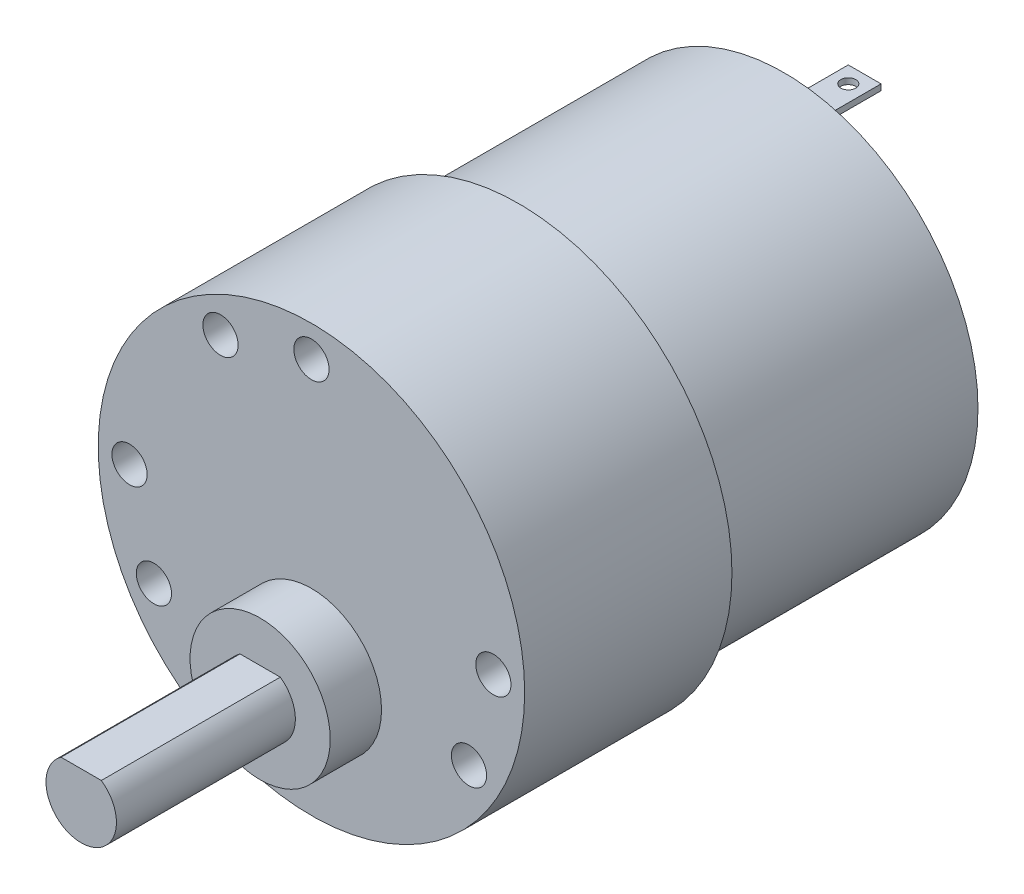
ISO-10303-21;
HEADER;
FILE_DESCRIPTION(('STEP AP214'),'2;1');
FILE_NAME('part.step','',(''),(''),'','','');
FILE_SCHEMA(('AUTOMOTIVE_DESIGN { 1 0 10303 214 1 1 1 1 }'));
ENDSEC;
DATA;
#1=APPLICATION_CONTEXT('core data for automotive mechanical design processes');
#2=APPLICATION_PROTOCOL_DEFINITION('international standard','automotive_design',2000,#1);
#3=PRODUCT_CONTEXT('',#1,'mechanical');
#4=PRODUCT('Part','Part','',(#3));
#5=PRODUCT_RELATED_PRODUCT_CATEGORY('part','',(#4));
#6=PRODUCT_DEFINITION_FORMATION('','',#4);
#7=PRODUCT_DEFINITION_CONTEXT('part definition',#1,'design');
#8=PRODUCT_DEFINITION('design','',#6,#7);
#9=PRODUCT_DEFINITION_SHAPE('','',#8);
#10=(LENGTH_UNIT() NAMED_UNIT(*) SI_UNIT(.MILLI.,.METRE.));
#11=(NAMED_UNIT(*) PLANE_ANGLE_UNIT() SI_UNIT($,.RADIAN.));
#12=(NAMED_UNIT(*) SI_UNIT($,.STERADIAN.) SOLID_ANGLE_UNIT());
#13=UNCERTAINTY_MEASURE_WITH_UNIT(LENGTH_MEASURE(1.E-05),#10,'distance_accuracy_value','');
#14=(GEOMETRIC_REPRESENTATION_CONTEXT(3) GLOBAL_UNCERTAINTY_ASSIGNED_CONTEXT((#13)) GLOBAL_UNIT_ASSIGNED_CONTEXT((#10,
#11,#12)) REPRESENTATION_CONTEXT('',''));
#15=CARTESIAN_POINT('',(0.,0.,0.));
#16=DIRECTION('',(0.,0.,1.));
#17=DIRECTION('',(1.,0.,0.));
#18=AXIS2_PLACEMENT_3D('',#15,#16,#17);
#19=CARTESIAN_POINT('',(0.,-12.7,-23.876));
#20=DIRECTION('',(0.,0.,-1.));
#21=DIRECTION('',(-1.,0.,0.));
#22=AXIS2_PLACEMENT_3D('',#19,#20,#21);
#23=PLANE('',#22);
#24=CARTESIAN_POINT('',(0.,-12.7,-23.876));
#25=DIRECTION('',(0.,0.,-1.));
#26=DIRECTION('',(-1.,0.,0.));
#27=AXIS2_PLACEMENT_3D('',#24,#25,#26);
#28=CIRCLE('',#27,2.413);
#29=CARTESIAN_POINT('',(-2.413,-12.7,-23.876));
#30=VERTEX_POINT('',#29);
#31=EDGE_CURVE('E278',#30,#30,#28,.T.);
#32=ORIENTED_EDGE('',*,*,#31,.T.);
#33=EDGE_LOOP('',(#32));
#34=FACE_BOUND('',#33,.T.);
#35=DIRECTION('',(-1.,0.,0.));
#36=VECTOR('',#35,1.);
#37=CARTESIAN_POINT('',(-1.397,-12.446,-23.876));
#38=LINE('',#37,#36);
#39=CARTESIAN_POINT('',(1.397,-12.446,-23.876));
#40=VERTEX_POINT('',#39);
#41=CARTESIAN_POINT('',(-1.397,-12.446,-23.876));
#42=VERTEX_POINT('',#41);
#43=EDGE_CURVE('E48',#40,#42,#38,.T.);
#44=ORIENTED_EDGE('',*,*,#43,.T.);
#45=DIRECTION('',(0.,1.,0.));
#46=VECTOR('',#45,1.);
#47=CARTESIAN_POINT('',(-1.397,-12.954,-23.876));
#48=LINE('',#47,#46);
#49=CARTESIAN_POINT('',(-1.397,-12.954,-23.876));
#50=VERTEX_POINT('',#49);
#51=EDGE_CURVE('E213',#50,#42,#48,.T.);
#52=ORIENTED_EDGE('',*,*,#51,.F.);
#53=DIRECTION('',(-1.,0.,0.));
#54=VECTOR('',#53,1.);
#55=CARTESIAN_POINT('',(-1.397,-12.954,-23.876));
#56=LINE('',#55,#54);
#57=CARTESIAN_POINT('',(1.397,-12.954,-23.876));
#58=VERTEX_POINT('',#57);
#59=EDGE_CURVE('E188',#58,#50,#56,.T.);
#60=ORIENTED_EDGE('',*,*,#59,.F.);
#61=DIRECTION('',(0.,1.,0.));
#62=VECTOR('',#61,1.);
#63=CARTESIAN_POINT('',(1.397,-12.954,-23.876));
#64=LINE('',#63,#62);
#65=EDGE_CURVE('E198',#58,#40,#64,.T.);
#66=ORIENTED_EDGE('',*,*,#65,.T.);
#67=EDGE_LOOP('',(#44,#52,#60,#66));
#68=FACE_BOUND('',#67,.T.);
#69=ADVANCED_FACE('F33',(#34,#68),#23,.T.);
#70=CARTESIAN_POINT('',(0.,12.7,-23.876));
#71=DIRECTION('',(0.,0.,-1.));
#72=DIRECTION('',(-1.,0.,0.));
#73=AXIS2_PLACEMENT_3D('',#70,#71,#72);
#74=PLANE('',#73);
#75=CARTESIAN_POINT('',(0.,12.7,-23.876));
#76=DIRECTION('',(0.,0.,-1.));
#77=DIRECTION('',(-1.,0.,0.));
#78=AXIS2_PLACEMENT_3D('',#75,#76,#77);
#79=CIRCLE('',#78,2.413);
#80=CARTESIAN_POINT('',(-2.413,12.7,-23.876));
#81=VERTEX_POINT('',#80);
#82=EDGE_CURVE('E272',#81,#81,#79,.T.);
#83=ORIENTED_EDGE('',*,*,#82,.T.);
#84=EDGE_LOOP('',(#83));
#85=FACE_BOUND('',#84,.T.);
#86=DIRECTION('',(1.,0.,0.));
#87=VECTOR('',#86,1.);
#88=CARTESIAN_POINT('',(1.397,12.446,-23.876));
#89=LINE('',#88,#87);
#90=CARTESIAN_POINT('',(-1.397,12.446,-23.876));
#91=VERTEX_POINT('',#90);
#92=CARTESIAN_POINT('',(1.397,12.446,-23.876));
#93=VERTEX_POINT('',#92);
#94=EDGE_CURVE('E56',#91,#93,#89,.T.);
#95=ORIENTED_EDGE('',*,*,#94,.T.);
#96=DIRECTION('',(0.,-1.,0.));
#97=VECTOR('',#96,1.);
#98=CARTESIAN_POINT('',(1.397,12.954,-23.876));
#99=LINE('',#98,#97);
#100=CARTESIAN_POINT('',(1.397,12.954,-23.876));
#101=VERTEX_POINT('',#100);
#102=EDGE_CURVE('E247',#101,#93,#99,.T.);
#103=ORIENTED_EDGE('',*,*,#102,.F.);
#104=DIRECTION('',(1.,0.,0.));
#105=VECTOR('',#104,1.);
#106=CARTESIAN_POINT('',(1.397,12.954,-23.876));
#107=LINE('',#106,#105);
#108=CARTESIAN_POINT('',(-1.397,12.954,-23.876));
#109=VERTEX_POINT('',#108);
#110=EDGE_CURVE('E222',#109,#101,#107,.T.);
#111=ORIENTED_EDGE('',*,*,#110,.F.);
#112=DIRECTION('',(0.,-1.,0.));
#113=VECTOR('',#112,1.);
#114=CARTESIAN_POINT('',(-1.397,12.954,-23.876));
#115=LINE('',#114,#113);
#116=EDGE_CURVE('E232',#109,#91,#115,.T.);
#117=ORIENTED_EDGE('',*,*,#116,.T.);
#118=EDGE_LOOP('',(#95,#103,#111,#117));
#119=FACE_BOUND('',#118,.T.);
#120=ADVANCED_FACE('F321',(#85,#119),#74,.T.);
#121=CARTESIAN_POINT('',(0.,-7.366,22.0218));
#122=DIRECTION('',(0.,0.,1.));
#123=DIRECTION('',(1.,0.,0.));
#124=AXIS2_PLACEMENT_3D('',#121,#122,#123);
#125=PLANE('',#124);
#126=CARTESIAN_POINT('',(0.,-7.366,22.0218));
#127=DIRECTION('',(0.,0.,1.));
#128=DIRECTION('',(1.,0.,0.));
#129=AXIS2_PLACEMENT_3D('',#126,#127,#128);
#130=CIRCLE('',#129,5.969);
#131=CARTESIAN_POINT('',(5.969,-7.366,22.0218));
#132=VERTEX_POINT('',#131);
#133=EDGE_CURVE('E266',#132,#132,#130,.T.);
#134=ORIENTED_EDGE('',*,*,#133,.T.);
#135=EDGE_LOOP('',(#134));
#136=FACE_BOUND('',#135,.T.);
#137=DIRECTION('',(-1.,0.,0.));
#138=VECTOR('',#137,1.);
#139=CARTESIAN_POINT('',(-1.71565701700544,-4.905,22.0218));
#140=LINE('',#139,#138);
#141=CARTESIAN_POINT('',(1.71565701700544,-4.905,22.0218));
#142=VERTEX_POINT('',#141);
#143=CARTESIAN_POINT('',(-1.71565701700544,-4.905,22.0218));
#144=VERTEX_POINT('',#143);
#145=EDGE_CURVE('E255',#142,#144,#140,.T.);
#146=ORIENTED_EDGE('',*,*,#145,.F.);
#147=CARTESIAN_POINT('',(0.,-7.366,22.0218));
#148=DIRECTION('',(0.,0.,1.));
#149=DIRECTION('',(1.,0.,0.));
#150=AXIS2_PLACEMENT_3D('',#147,#148,#149);
#151=CIRCLE('',#150,3.);
#152=EDGE_CURVE('E250',#144,#142,#151,.T.);
#153=ORIENTED_EDGE('',*,*,#152,.F.);
#154=EDGE_LOOP('',(#146,#153));
#155=FACE_BOUND('',#154,.T.);
#156=ADVANCED_FACE('F327',(#136,#155),#125,.T.);
#157=CARTESIAN_POINT('',(0.,0.,17.653));
#158=DIRECTION('',(0.,0.,1.));
#159=DIRECTION('',(1.,0.,0.));
#160=AXIS2_PLACEMENT_3D('',#157,#158,#159);
#161=PLANE('',#160);
#162=CARTESIAN_POINT('',(-7.74699999999983,13.4181976062362,17.653));
#163=DIRECTION('',(0.,0.,1.));
#164=DIRECTION('',(1.,0.,0.));
#165=AXIS2_PLACEMENT_3D('',#162,#163,#164);
#166=CIRCLE('',#165,1.49999999999999);
#167=CARTESIAN_POINT('',(-6.24699999999984,13.4181976062362,17.653));
#168=VERTEX_POINT('',#167);
#169=EDGE_CURVE('E142',#168,#168,#166,.T.);
#170=ORIENTED_EDGE('',*,*,#169,.F.);
#171=EDGE_LOOP('',(#170));
#172=FACE_BOUND('',#171,.T.);
#173=CARTESIAN_POINT('',(-15.494,1.62291035592107E-13,17.653));
#174=DIRECTION('',(0.,0.,1.));
#175=DIRECTION('',(1.,0.,0.));
#176=AXIS2_PLACEMENT_3D('',#173,#174,#175);
#177=CIRCLE('',#176,1.49999999999999);
#178=CARTESIAN_POINT('',(-13.994,1.62291035592107E-13,17.653));
#179=VERTEX_POINT('',#178);
#180=EDGE_CURVE('E141',#179,#179,#177,.T.);
#181=ORIENTED_EDGE('',*,*,#180,.F.);
#182=EDGE_LOOP('',(#181));
#183=FACE_BOUND('',#182,.T.);
#184=CARTESIAN_POINT('',(-13.4181976062362,-7.74699999999987,17.653));
#185=DIRECTION('',(0.,0.,1.));
#186=DIRECTION('',(1.,0.,0.));
#187=AXIS2_PLACEMENT_3D('',#184,#185,#186);
#188=CIRCLE('',#187,1.49999999999999);
#189=CARTESIAN_POINT('',(-11.9181976062362,-7.74699999999987,17.653));
#190=VERTEX_POINT('',#189);
#191=EDGE_CURVE('E152',#190,#190,#188,.T.);
#192=ORIENTED_EDGE('',*,*,#191,.F.);
#193=EDGE_LOOP('',(#192));
#194=FACE_BOUND('',#193,.T.);
#195=CARTESIAN_POINT('',(-7.74700000000011,-13.418197606236,17.653));
#196=DIRECTION('',(0.,0.,1.));
#197=DIRECTION('',(1.,0.,0.));
#198=AXIS2_PLACEMENT_3D('',#195,#196,#197);
#199=CIRCLE('',#198,1.49999999999999);
#200=CARTESIAN_POINT('',(-6.24700000000012,-13.418197606236,17.653));
#201=VERTEX_POINT('',#200);
#202=EDGE_CURVE('E158',#201,#201,#199,.T.);
#203=ORIENTED_EDGE('',*,*,#202,.F.);
#204=EDGE_LOOP('',(#203));
#205=FACE_BOUND('',#204,.T.);
#206=CARTESIAN_POINT('',(13.4181976062361,-7.74700000000006,17.653));
#207=DIRECTION('',(0.,0.,1.));
#208=DIRECTION('',(1.,0.,0.));
#209=AXIS2_PLACEMENT_3D('',#206,#207,#208);
#210=CIRCLE('',#209,1.49999999999999);
#211=CARTESIAN_POINT('',(14.918197606236,-7.74700000000006,17.653));
#212=VERTEX_POINT('',#211);
#213=EDGE_CURVE('E164',#212,#212,#210,.T.);
#214=ORIENTED_EDGE('',*,*,#213,.F.);
#215=EDGE_LOOP('',(#214));
#216=FACE_BOUND('',#215,.T.);
#217=CARTESIAN_POINT('',(15.494,0.,17.653));
#218=DIRECTION('',(0.,0.,1.));
#219=DIRECTION('',(1.,0.,0.));
#220=AXIS2_PLACEMENT_3D('',#217,#218,#219);
#221=CIRCLE('',#220,1.49999999999999);
#222=CARTESIAN_POINT('',(16.994,0.,17.653));
#223=VERTEX_POINT('',#222);
#224=EDGE_CURVE('E170',#223,#223,#221,.T.);
#225=ORIENTED_EDGE('',*,*,#224,.F.);
#226=EDGE_LOOP('',(#225));
#227=FACE_BOUND('',#226,.T.);
#228=CARTESIAN_POINT('',(0.,15.494,17.653));
#229=DIRECTION('',(0.,0.,1.));
#230=DIRECTION('',(1.,0.,0.));
#231=AXIS2_PLACEMENT_3D('',#228,#229,#230);
#232=CIRCLE('',#231,1.49999999999999);
#233=CARTESIAN_POINT('',(1.49999999999999,15.494,17.653));
#234=VERTEX_POINT('',#233);
#235=EDGE_CURVE('E176',#234,#234,#232,.T.);
#236=ORIENTED_EDGE('',*,*,#235,.F.);
#237=EDGE_LOOP('',(#236));
#238=FACE_BOUND('',#237,.T.);
#239=CARTESIAN_POINT('',(0.,0.,17.653));
#240=DIRECTION('',(0.,0.,1.));
#241=DIRECTION('',(1.,0.,0.));
#242=AXIS2_PLACEMENT_3D('',#239,#240,#241);
#243=CIRCLE('',#242,18.161);
#244=CARTESIAN_POINT('',(18.161,0.,17.653));
#245=VERTEX_POINT('',#244);
#246=EDGE_CURVE('E41',#245,#245,#243,.T.);
#247=ORIENTED_EDGE('',*,*,#246,.T.);
#248=EDGE_LOOP('',(#247));
#249=FACE_BOUND('',#248,.T.);
#250=CARTESIAN_POINT('',(0.,-7.366,17.653));
#251=DIRECTION('',(0.,0.,1.));
#252=DIRECTION('',(1.,0.,0.));
#253=AXIS2_PLACEMENT_3D('',#250,#251,#252);
#254=CIRCLE('',#253,5.969);
#255=CARTESIAN_POINT('',(5.969,-7.366,17.653));
#256=VERTEX_POINT('',#255);
#257=EDGE_CURVE('E265',#256,#256,#254,.T.);
#258=ORIENTED_EDGE('',*,*,#257,.F.);
#259=EDGE_LOOP('',(#258));
#260=FACE_BOUND('',#259,.T.);
#261=ADVANCED_FACE('F341',(#172,#183,#194,#205,#216,#227,#238,#249,#260),#161,.T.);
#262=CARTESIAN_POINT('',(0.,0.,-22.606));
#263=DIRECTION('',(0.,0.,-1.));
#264=DIRECTION('',(-1.,0.,0.));
#265=AXIS2_PLACEMENT_3D('',#262,#263,#264);
#266=PLANE('',#265);
#267=CARTESIAN_POINT('',(0.,-12.7,-22.606));
#268=DIRECTION('',(0.,0.,-1.));
#269=DIRECTION('',(-1.,0.,0.));
#270=AXIS2_PLACEMENT_3D('',#267,#268,#269);
#271=CIRCLE('',#270,2.413);
#272=CARTESIAN_POINT('',(-2.413,-12.7,-22.606));
#273=VERTEX_POINT('',#272);
#274=EDGE_CURVE('E275',#273,#273,#271,.T.);
#275=ORIENTED_EDGE('',*,*,#274,.F.);
#276=EDGE_LOOP('',(#275));
#277=FACE_BOUND('',#276,.T.);
#278=CARTESIAN_POINT('',(0.,0.,-22.606));
#279=DIRECTION('',(0.,0.,-1.));
#280=DIRECTION('',(-1.,0.,0.));
#281=AXIS2_PLACEMENT_3D('',#278,#279,#280);
#282=CIRCLE('',#281,16.51);
#283=CARTESIAN_POINT('',(-16.51,0.,-22.606));
#284=VERTEX_POINT('',#283);
#285=EDGE_CURVE('E287',#284,#284,#282,.T.);
#286=ORIENTED_EDGE('',*,*,#285,.T.);
#287=EDGE_LOOP('',(#286));
#288=FACE_BOUND('',#287,.T.);
#289=CARTESIAN_POINT('',(0.,0.,-22.606));
#290=DIRECTION('',(0.,0.,-1.));
#291=DIRECTION('',(-1.,0.,0.));
#292=AXIS2_PLACEMENT_3D('',#289,#290,#291);
#293=CIRCLE('',#292,4.5085);
#294=CARTESIAN_POINT('',(-4.5085,0.,-22.606));
#295=VERTEX_POINT('',#294);
#296=EDGE_CURVE('E281',#295,#295,#293,.T.);
#297=ORIENTED_EDGE('',*,*,#296,.F.);
#298=EDGE_LOOP('',(#297));
#299=FACE_BOUND('',#298,.T.);
#300=CARTESIAN_POINT('',(0.,12.7,-22.606));
#301=DIRECTION('',(0.,0.,-1.));
#302=DIRECTION('',(-1.,0.,0.));
#303=AXIS2_PLACEMENT_3D('',#300,#301,#302);
#304=CIRCLE('',#303,2.413);
#305=CARTESIAN_POINT('',(-2.413,12.7,-22.606));
#306=VERTEX_POINT('',#305);
#307=EDGE_CURVE('E269',#306,#306,#304,.T.);
#308=ORIENTED_EDGE('',*,*,#307,.F.);
#309=EDGE_LOOP('',(#308));
#310=FACE_BOUND('',#309,.T.);
#311=ADVANCED_FACE('F301',(#277,#288,#299,#310),#266,.T.);
#312=CARTESIAN_POINT('',(0.,0.,0.));
#313=DIRECTION('',(0.,0.,1.));
#314=DIRECTION('',(1.,0.,0.));
#315=AXIS2_PLACEMENT_3D('',#312,#313,#314);
#316=PLANE('',#315);
#317=CARTESIAN_POINT('',(0.,0.,0.));
#318=DIRECTION('',(0.,0.,1.));
#319=DIRECTION('',(1.,0.,0.));
#320=AXIS2_PLACEMENT_3D('',#317,#318,#319);
#321=CIRCLE('',#320,18.161);
#322=CARTESIAN_POINT('',(18.161,0.,0.));
#323=VERTEX_POINT('',#322);
#324=EDGE_CURVE('E292',#323,#323,#321,.T.);
#325=ORIENTED_EDGE('',*,*,#324,.F.);
#326=EDGE_LOOP('',(#325));
#327=FACE_BOUND('',#326,.T.);
#328=CARTESIAN_POINT('',(0.,0.,0.));
#329=DIRECTION('',(0.,0.,1.));
#330=DIRECTION('',(1.,0.,0.));
#331=AXIS2_PLACEMENT_3D('',#328,#329,#330);
#332=CIRCLE('',#331,16.51);
#333=CARTESIAN_POINT('',(16.51,0.,0.));
#334=VERTEX_POINT('',#333);
#335=EDGE_CURVE('E11',#334,#334,#332,.F.);
#336=ORIENTED_EDGE('',*,*,#335,.F.);
#337=EDGE_LOOP('',(#336));
#338=FACE_BOUND('',#337,.T.);
#339=ADVANCED_FACE('F298',(#327,#338),#316,.F.);
#340=CARTESIAN_POINT('',(0.,0.,17.653));
#341=DIRECTION('',(0.,0.,-1.));
#342=DIRECTION('',(-1.,0.,0.));
#343=AXIS2_PLACEMENT_3D('',#340,#341,#342);
#344=CYLINDRICAL_SURFACE('',#343,18.161);
#345=ORIENTED_EDGE('',*,*,#246,.F.);
#346=EDGE_LOOP('',(#345));
#347=FACE_BOUND('',#346,.T.);
#348=ORIENTED_EDGE('',*,*,#324,.T.);
#349=EDGE_LOOP('',(#348));
#350=FACE_BOUND('',#349,.T.);
#351=ADVANCED_FACE('F35',(#347,#350),#344,.T.);
#352=CARTESIAN_POINT('',(0.,0.,-22.606));
#353=DIRECTION('',(0.,0.,1.));
#354=DIRECTION('',(1.,0.,0.));
#355=AXIS2_PLACEMENT_3D('',#352,#353,#354);
#356=CYLINDRICAL_SURFACE('',#355,16.51);
#357=ORIENTED_EDGE('',*,*,#285,.F.);
#358=EDGE_LOOP('',(#357));
#359=FACE_BOUND('',#358,.T.);
#360=ORIENTED_EDGE('',*,*,#335,.T.);
#361=EDGE_LOOP('',(#360));
#362=FACE_BOUND('',#361,.T.);
#363=ADVANCED_FACE('F304',(#359,#362),#356,.T.);
#364=CARTESIAN_POINT('',(0.,0.,-25.908));
#365=DIRECTION('',(0.,0.,1.));
#366=DIRECTION('',(1.,0.,0.));
#367=AXIS2_PLACEMENT_3D('',#364,#365,#366);
#368=CYLINDRICAL_SURFACE('',#367,4.5085);
#369=CARTESIAN_POINT('',(0.,0.,-25.908));
#370=DIRECTION('',(0.,0.,-1.));
#371=DIRECTION('',(-1.,0.,0.));
#372=AXIS2_PLACEMENT_3D('',#369,#370,#371);
#373=CIRCLE('',#372,4.5085);
#374=CARTESIAN_POINT('',(-4.5085,0.,-25.908));
#375=VERTEX_POINT('',#374);
#376=EDGE_CURVE('E284',#375,#375,#373,.T.);
#377=ORIENTED_EDGE('',*,*,#376,.F.);
#378=EDGE_LOOP('',(#377));
#379=FACE_BOUND('',#378,.T.);
#380=ORIENTED_EDGE('',*,*,#296,.T.);
#381=EDGE_LOOP('',(#380));
#382=FACE_BOUND('',#381,.T.);
#383=ADVANCED_FACE('F306',(#379,#382),#368,.T.);
#384=CARTESIAN_POINT('',(0.,0.,-25.908));
#385=DIRECTION('',(0.,0.,-1.));
#386=DIRECTION('',(-1.,0.,0.));
#387=AXIS2_PLACEMENT_3D('',#384,#385,#386);
#388=PLANE('',#387);
#389=ORIENTED_EDGE('',*,*,#376,.T.);
#390=EDGE_LOOP('',(#389));
#391=FACE_BOUND('',#390,.T.);
#392=ADVANCED_FACE('F313',(#391),#388,.T.);
#393=CARTESIAN_POINT('',(0.,-12.7,-23.876));
#394=DIRECTION('',(0.,0.,1.));
#395=DIRECTION('',(1.,0.,0.));
#396=AXIS2_PLACEMENT_3D('',#393,#394,#395);
#397=CYLINDRICAL_SURFACE('',#396,2.413);
#398=ORIENTED_EDGE('',*,*,#31,.F.);
#399=EDGE_LOOP('',(#398));
#400=FACE_BOUND('',#399,.T.);
#401=ORIENTED_EDGE('',*,*,#274,.T.);
#402=EDGE_LOOP('',(#401));
#403=FACE_BOUND('',#402,.T.);
#404=ADVANCED_FACE('F334',(#400,#403),#397,.T.);
#405=CARTESIAN_POINT('',(0.,12.7,-23.876));
#406=DIRECTION('',(0.,0.,1.));
#407=DIRECTION('',(1.,0.,0.));
#408=AXIS2_PLACEMENT_3D('',#405,#406,#407);
#409=CYLINDRICAL_SURFACE('',#408,2.413);
#410=ORIENTED_EDGE('',*,*,#82,.F.);
#411=EDGE_LOOP('',(#410));
#412=FACE_BOUND('',#411,.T.);
#413=ORIENTED_EDGE('',*,*,#307,.T.);
#414=EDGE_LOOP('',(#413));
#415=FACE_BOUND('',#414,.T.);
#416=ADVANCED_FACE('F333',(#412,#415),#409,.T.);
#417=CARTESIAN_POINT('',(0.,-7.366,22.0218));
#418=DIRECTION('',(0.,0.,-1.));
#419=DIRECTION('',(-1.,0.,0.));
#420=AXIS2_PLACEMENT_3D('',#417,#418,#419);
#421=CYLINDRICAL_SURFACE('',#420,5.969);
#422=ORIENTED_EDGE('',*,*,#133,.F.);
#423=EDGE_LOOP('',(#422));
#424=FACE_BOUND('',#423,.T.);
#425=ORIENTED_EDGE('',*,*,#257,.T.);
#426=EDGE_LOOP('',(#425));
#427=FACE_BOUND('',#426,.T.);
#428=ADVANCED_FACE('F355',(#424,#427),#421,.T.);
#429=CARTESIAN_POINT('',(0.,-7.366,37.2618));
#430=DIRECTION('',(0.,0.,-1.));
#431=DIRECTION('',(-1.,0.,0.));
#432=AXIS2_PLACEMENT_3D('',#429,#430,#431);
#433=CYLINDRICAL_SURFACE('',#432,3.);
#434=ORIENTED_EDGE('',*,*,#152,.T.);
#435=DIRECTION('',(0.,0.,-1.));
#436=VECTOR('',#435,1.);
#437=CARTESIAN_POINT('',(1.71565701700544,-4.905,37.2618));
#438=LINE('',#437,#436);
#439=CARTESIAN_POINT('',(1.71565701700544,-4.905,37.2618));
#440=VERTEX_POINT('',#439);
#441=EDGE_CURVE('E262',#440,#142,#438,.T.);
#442=ORIENTED_EDGE('',*,*,#441,.F.);
#443=CARTESIAN_POINT('',(0.,-7.366,37.2618));
#444=DIRECTION('',(0.,0.,1.));
#445=DIRECTION('',(1.,0.,0.));
#446=AXIS2_PLACEMENT_3D('',#443,#444,#445);
#447=CIRCLE('',#446,3.);
#448=CARTESIAN_POINT('',(-1.71565701700544,-4.905,37.2618));
#449=VERTEX_POINT('',#448);
#450=EDGE_CURVE('E251',#449,#440,#447,.T.);
#451=ORIENTED_EDGE('',*,*,#450,.F.);
#452=DIRECTION('',(0.,0.,-1.));
#453=VECTOR('',#452,1.);
#454=CARTESIAN_POINT('',(-1.71565701700544,-4.905,37.2618));
#455=LINE('',#454,#453);
#456=EDGE_CURVE('E257',#449,#144,#455,.T.);
#457=ORIENTED_EDGE('',*,*,#456,.T.);
#458=EDGE_LOOP('',(#434,#442,#451,#457));
#459=FACE_BOUND('',#458,.T.);
#460=ADVANCED_FACE('F360',(#459),#433,.T.);
#461=CARTESIAN_POINT('',(-1.71565701700544,-4.905,37.2618));
#462=DIRECTION('',(0.,-1.,0.));
#463=DIRECTION('',(0.,0.,-1.));
#464=AXIS2_PLACEMENT_3D('',#461,#462,#463);
#465=PLANE('',#464);
#466=ORIENTED_EDGE('',*,*,#145,.T.);
#467=ORIENTED_EDGE('',*,*,#456,.F.);
#468=DIRECTION('',(-1.,0.,0.));
#469=VECTOR('',#468,1.);
#470=CARTESIAN_POINT('',(-1.71565701700544,-4.905,37.2618));
#471=LINE('',#470,#469);
#472=EDGE_CURVE('E254',#440,#449,#471,.T.);
#473=ORIENTED_EDGE('',*,*,#472,.F.);
#474=ORIENTED_EDGE('',*,*,#441,.T.);
#475=EDGE_LOOP('',(#466,#467,#473,#474));
#476=FACE_BOUND('',#475,.T.);
#477=ADVANCED_FACE('F408',(#476),#465,.F.);
#478=CARTESIAN_POINT('',(0.,-7.366,37.2618));
#479=DIRECTION('',(0.,0.,1.));
#480=DIRECTION('',(1.,0.,0.));
#481=AXIS2_PLACEMENT_3D('',#478,#479,#480);
#482=PLANE('',#481);
#483=ORIENTED_EDGE('',*,*,#450,.T.);
#484=ORIENTED_EDGE('',*,*,#472,.T.);
#485=EDGE_LOOP('',(#483,#484));
#486=FACE_BOUND('',#485,.T.);
#487=ADVANCED_FACE('F385',(#486),#482,.T.);
#488=CARTESIAN_POINT('',(0.,12.954,0.));
#489=DIRECTION('',(0.,-1.,0.));
#490=DIRECTION('',(0.,0.,-1.));
#491=AXIS2_PLACEMENT_3D('',#488,#489,#490);
#492=PLANE('',#491);
#493=ORIENTED_EDGE('',*,*,#110,.T.);
#494=DIRECTION('',(0.,0.,-1.));
#495=VECTOR('',#494,1.);
#496=CARTESIAN_POINT('',(1.397,12.954,-23.876));
#497=LINE('',#496,#495);
#498=CARTESIAN_POINT('',(1.397,12.954,-29.464));
#499=VERTEX_POINT('',#498);
#500=EDGE_CURVE('E225',#101,#499,#497,.T.);
#501=ORIENTED_EDGE('',*,*,#500,.T.);
#502=DIRECTION('',(-1.,0.,0.));
#503=VECTOR('',#502,1.);
#504=CARTESIAN_POINT('',(1.397,12.954,-29.464));
#505=LINE('',#504,#503);
#506=CARTESIAN_POINT('',(-1.397,12.954,-29.464));
#507=VERTEX_POINT('',#506);
#508=EDGE_CURVE('E228',#499,#507,#505,.T.);
#509=ORIENTED_EDGE('',*,*,#508,.T.);
#510=DIRECTION('',(0.,0.,1.));
#511=VECTOR('',#510,1.);
#512=CARTESIAN_POINT('',(-1.397,12.954,-23.876));
#513=LINE('',#512,#511);
#514=EDGE_CURVE('E230',#507,#109,#513,.T.);
#515=ORIENTED_EDGE('',*,*,#514,.T.);
#516=EDGE_LOOP('',(#493,#501,#509,#515));
#517=FACE_BOUND('',#516,.T.);
#518=CARTESIAN_POINT('',(0.,12.954,-28.067));
#519=DIRECTION('',(0.,1.,0.));
#520=DIRECTION('',(0.,0.,1.));
#521=AXIS2_PLACEMENT_3D('',#518,#519,#520);
#522=CIRCLE('',#521,0.634999999999999);
#523=CARTESIAN_POINT('',(0.,12.954,-27.432));
#524=VERTEX_POINT('',#523);
#525=EDGE_CURVE('E217',#524,#524,#522,.T.);
#526=ORIENTED_EDGE('',*,*,#525,.F.);
#527=EDGE_LOOP('',(#526));
#528=FACE_BOUND('',#527,.T.);
#529=ADVANCED_FACE('F382',(#517,#528),#492,.F.);
#530=CARTESIAN_POINT('',(0.,12.446,0.));
#531=DIRECTION('',(0.,-1.,0.));
#532=DIRECTION('',(0.,0.,-1.));
#533=AXIS2_PLACEMENT_3D('',#530,#531,#532);
#534=PLANE('',#533);
#535=ORIENTED_EDGE('',*,*,#94,.F.);
#536=DIRECTION('',(0.,0.,1.));
#537=VECTOR('',#536,1.);
#538=CARTESIAN_POINT('',(-1.397,12.446,-23.876));
#539=LINE('',#538,#537);
#540=CARTESIAN_POINT('',(-1.397,12.446,-29.464));
#541=VERTEX_POINT('',#540);
#542=EDGE_CURVE('E226',#541,#91,#539,.T.);
#543=ORIENTED_EDGE('',*,*,#542,.F.);
#544=DIRECTION('',(-1.,0.,0.));
#545=VECTOR('',#544,1.);
#546=CARTESIAN_POINT('',(1.397,12.446,-29.464));
#547=LINE('',#546,#545);
#548=CARTESIAN_POINT('',(1.397,12.446,-29.464));
#549=VERTEX_POINT('',#548);
#550=EDGE_CURVE('E236',#549,#541,#547,.T.);
#551=ORIENTED_EDGE('',*,*,#550,.F.);
#552=DIRECTION('',(0.,0.,-1.));
#553=VECTOR('',#552,1.);
#554=CARTESIAN_POINT('',(1.397,12.446,-23.876));
#555=LINE('',#554,#553);
#556=EDGE_CURVE('E234',#93,#549,#555,.T.);
#557=ORIENTED_EDGE('',*,*,#556,.F.);
#558=EDGE_LOOP('',(#535,#543,#551,#557));
#559=FACE_BOUND('',#558,.T.);
#560=CARTESIAN_POINT('',(0.,12.446,-28.067));
#561=DIRECTION('',(0.,1.,0.));
#562=DIRECTION('',(0.,0.,1.));
#563=AXIS2_PLACEMENT_3D('',#560,#561,#562);
#564=CIRCLE('',#563,0.634999999999999);
#565=CARTESIAN_POINT('',(0.,12.446,-27.432));
#566=VERTEX_POINT('',#565);
#567=EDGE_CURVE('E216',#566,#566,#564,.T.);
#568=ORIENTED_EDGE('',*,*,#567,.T.);
#569=EDGE_LOOP('',(#568));
#570=FACE_BOUND('',#569,.T.);
#571=ADVANCED_FACE('F373',(#559,#570),#534,.T.);
#572=CARTESIAN_POINT('',(1.397,12.954,-23.876));
#573=DIRECTION('',(-1.,0.,0.));
#574=DIRECTION('',(0.,0.,1.));
#575=AXIS2_PLACEMENT_3D('',#572,#573,#574);
#576=PLANE('',#575);
#577=ORIENTED_EDGE('',*,*,#556,.T.);
#578=DIRECTION('',(0.,-1.,0.));
#579=VECTOR('',#578,1.);
#580=CARTESIAN_POINT('',(1.397,12.954,-29.464));
#581=LINE('',#580,#579);
#582=EDGE_CURVE('E244',#499,#549,#581,.T.);
#583=ORIENTED_EDGE('',*,*,#582,.F.);
#584=ORIENTED_EDGE('',*,*,#500,.F.);
#585=ORIENTED_EDGE('',*,*,#102,.T.);
#586=EDGE_LOOP('',(#577,#583,#584,#585));
#587=FACE_BOUND('',#586,.T.);
#588=ADVANCED_FACE('F380',(#587),#576,.F.);
#589=CARTESIAN_POINT('',(1.397,12.954,-29.464));
#590=DIRECTION('',(0.,0.,1.));
#591=DIRECTION('',(1.,0.,0.));
#592=AXIS2_PLACEMENT_3D('',#589,#590,#591);
#593=PLANE('',#592);
#594=ORIENTED_EDGE('',*,*,#550,.T.);
#595=DIRECTION('',(0.,-1.,0.));
#596=VECTOR('',#595,1.);
#597=CARTESIAN_POINT('',(-1.397,12.954,-29.464));
#598=LINE('',#597,#596);
#599=EDGE_CURVE('E241',#507,#541,#598,.T.);
#600=ORIENTED_EDGE('',*,*,#599,.F.);
#601=ORIENTED_EDGE('',*,*,#508,.F.);
#602=ORIENTED_EDGE('',*,*,#582,.T.);
#603=EDGE_LOOP('',(#594,#600,#601,#602));
#604=FACE_BOUND('',#603,.T.);
#605=ADVANCED_FACE('F376',(#604),#593,.F.);
#606=CARTESIAN_POINT('',(-1.397,12.954,-23.876));
#607=DIRECTION('',(1.,0.,0.));
#608=DIRECTION('',(0.,0.,-1.));
#609=AXIS2_PLACEMENT_3D('',#606,#607,#608);
#610=PLANE('',#609);
#611=ORIENTED_EDGE('',*,*,#542,.T.);
#612=ORIENTED_EDGE('',*,*,#116,.F.);
#613=ORIENTED_EDGE('',*,*,#514,.F.);
#614=ORIENTED_EDGE('',*,*,#599,.T.);
#615=EDGE_LOOP('',(#611,#612,#613,#614));
#616=FACE_BOUND('',#615,.T.);
#617=ADVANCED_FACE('F370',(#616),#610,.F.);
#618=CARTESIAN_POINT('',(0.,12.954,-28.067));
#619=DIRECTION('',(0.,-1.,0.));
#620=DIRECTION('',(0.,0.,-1.));
#621=AXIS2_PLACEMENT_3D('',#618,#619,#620);
#622=CYLINDRICAL_SURFACE('',#621,0.634999999999999);
#623=ORIENTED_EDGE('',*,*,#525,.T.);
#624=EDGE_LOOP('',(#623));
#625=FACE_BOUND('',#624,.T.);
#626=ORIENTED_EDGE('',*,*,#567,.F.);
#627=EDGE_LOOP('',(#626));
#628=FACE_BOUND('',#627,.T.);
#629=ADVANCED_FACE('F389',(#625,#628),#622,.F.);
#630=CARTESIAN_POINT('',(0.,-12.954,0.));
#631=DIRECTION('',(0.,1.,0.));
#632=DIRECTION('',(0.,0.,-1.));
#633=AXIS2_PLACEMENT_3D('',#630,#631,#632);
#634=PLANE('',#633);
#635=ORIENTED_EDGE('',*,*,#59,.T.);
#636=DIRECTION('',(0.,0.,-1.));
#637=VECTOR('',#636,1.);
#638=CARTESIAN_POINT('',(-1.397,-12.954,-23.876));
#639=LINE('',#638,#637);
#640=CARTESIAN_POINT('',(-1.397,-12.954,-29.464));
#641=VERTEX_POINT('',#640);
#642=EDGE_CURVE('E191',#50,#641,#639,.T.);
#643=ORIENTED_EDGE('',*,*,#642,.T.);
#644=DIRECTION('',(1.,0.,0.));
#645=VECTOR('',#644,1.);
#646=CARTESIAN_POINT('',(-1.397,-12.954,-29.464));
#647=LINE('',#646,#645);
#648=CARTESIAN_POINT('',(1.397,-12.954,-29.464));
#649=VERTEX_POINT('',#648);
#650=EDGE_CURVE('E194',#641,#649,#647,.T.);
#651=ORIENTED_EDGE('',*,*,#650,.T.);
#652=DIRECTION('',(0.,0.,1.));
#653=VECTOR('',#652,1.);
#654=CARTESIAN_POINT('',(1.397,-12.954,-23.876));
#655=LINE('',#654,#653);
#656=EDGE_CURVE('E196',#649,#58,#655,.T.);
#657=ORIENTED_EDGE('',*,*,#656,.T.);
#658=EDGE_LOOP('',(#635,#643,#651,#657));
#659=FACE_BOUND('',#658,.T.);
#660=CARTESIAN_POINT('',(0.,-12.954,-28.067));
#661=DIRECTION('',(0.,-1.,0.));
#662=DIRECTION('',(0.,0.,1.));
#663=AXIS2_PLACEMENT_3D('',#660,#661,#662);
#664=CIRCLE('',#663,0.634999999999999);
#665=CARTESIAN_POINT('',(0.,-12.954,-27.432));
#666=VERTEX_POINT('',#665);
#667=EDGE_CURVE('E183',#666,#666,#664,.T.);
#668=ORIENTED_EDGE('',*,*,#667,.F.);
#669=EDGE_LOOP('',(#668));
#670=FACE_BOUND('',#669,.T.);
#671=ADVANCED_FACE('F392',(#659,#670),#634,.F.);
#672=CARTESIAN_POINT('',(0.,-12.446,0.));
#673=DIRECTION('',(0.,1.,0.));
#674=DIRECTION('',(0.,0.,-1.));
#675=AXIS2_PLACEMENT_3D('',#672,#673,#674);
#676=PLANE('',#675);
#677=ORIENTED_EDGE('',*,*,#43,.F.);
#678=DIRECTION('',(0.,0.,1.));
#679=VECTOR('',#678,1.);
#680=CARTESIAN_POINT('',(1.397,-12.446,-23.876));
#681=LINE('',#680,#679);
#682=CARTESIAN_POINT('',(1.397,-12.446,-29.464));
#683=VERTEX_POINT('',#682);
#684=EDGE_CURVE('E192',#683,#40,#681,.T.);
#685=ORIENTED_EDGE('',*,*,#684,.F.);
#686=DIRECTION('',(1.,0.,0.));
#687=VECTOR('',#686,1.);
#688=CARTESIAN_POINT('',(-1.397,-12.446,-29.464));
#689=LINE('',#688,#687);
#690=CARTESIAN_POINT('',(-1.397,-12.446,-29.464));
#691=VERTEX_POINT('',#690);
#692=EDGE_CURVE('E202',#691,#683,#689,.T.);
#693=ORIENTED_EDGE('',*,*,#692,.F.);
#694=DIRECTION('',(0.,0.,-1.));
#695=VECTOR('',#694,1.);
#696=CARTESIAN_POINT('',(-1.397,-12.446,-23.876));
#697=LINE('',#696,#695);
#698=EDGE_CURVE('E200',#42,#691,#697,.T.);
#699=ORIENTED_EDGE('',*,*,#698,.F.);
#700=EDGE_LOOP('',(#677,#685,#693,#699));
#701=FACE_BOUND('',#700,.T.);
#702=CARTESIAN_POINT('',(0.,-12.446,-28.067));
#703=DIRECTION('',(0.,-1.,0.));
#704=DIRECTION('',(0.,0.,1.));
#705=AXIS2_PLACEMENT_3D('',#702,#703,#704);
#706=CIRCLE('',#705,0.634999999999999);
#707=CARTESIAN_POINT('',(0.,-12.446,-27.432));
#708=VERTEX_POINT('',#707);
#709=EDGE_CURVE('E182',#708,#708,#706,.T.);
#710=ORIENTED_EDGE('',*,*,#709,.T.);
#711=EDGE_LOOP('',(#710));
#712=FACE_BOUND('',#711,.T.);
#713=ADVANCED_FACE('F578',(#701,#712),#676,.T.);
#714=CARTESIAN_POINT('',(-1.397,-12.954,-23.876));
#715=DIRECTION('',(1.,0.,0.));
#716=DIRECTION('',(0.,0.,-1.));
#717=AXIS2_PLACEMENT_3D('',#714,#715,#716);
#718=PLANE('',#717);
#719=ORIENTED_EDGE('',*,*,#698,.T.);
#720=DIRECTION('',(0.,1.,0.));
#721=VECTOR('',#720,1.);
#722=CARTESIAN_POINT('',(-1.397,-12.954,-29.464));
#723=LINE('',#722,#721);
#724=EDGE_CURVE('E210',#641,#691,#723,.T.);
#725=ORIENTED_EDGE('',*,*,#724,.F.);
#726=ORIENTED_EDGE('',*,*,#642,.F.);
#727=ORIENTED_EDGE('',*,*,#51,.T.);
#728=EDGE_LOOP('',(#719,#725,#726,#727));
#729=FACE_BOUND('',#728,.T.);
#730=ADVANCED_FACE('F582',(#729),#718,.F.);
#731=CARTESIAN_POINT('',(-1.397,-12.954,-29.464));
#732=DIRECTION('',(0.,0.,1.));
#733=DIRECTION('',(1.,0.,0.));
#734=AXIS2_PLACEMENT_3D('',#731,#732,#733);
#735=PLANE('',#734);
#736=ORIENTED_EDGE('',*,*,#692,.T.);
#737=DIRECTION('',(0.,1.,0.));
#738=VECTOR('',#737,1.);
#739=CARTESIAN_POINT('',(1.397,-12.954,-29.464));
#740=LINE('',#739,#738);
#741=EDGE_CURVE('E207',#649,#683,#740,.T.);
#742=ORIENTED_EDGE('',*,*,#741,.F.);
#743=ORIENTED_EDGE('',*,*,#650,.F.);
#744=ORIENTED_EDGE('',*,*,#724,.T.);
#745=EDGE_LOOP('',(#736,#742,#743,#744));
#746=FACE_BOUND('',#745,.T.);
#747=ADVANCED_FACE('F585',(#746),#735,.F.);
#748=CARTESIAN_POINT('',(1.397,-12.954,-23.876));
#749=DIRECTION('',(-1.,0.,0.));
#750=DIRECTION('',(0.,0.,1.));
#751=AXIS2_PLACEMENT_3D('',#748,#749,#750);
#752=PLANE('',#751);
#753=ORIENTED_EDGE('',*,*,#684,.T.);
#754=ORIENTED_EDGE('',*,*,#65,.F.);
#755=ORIENTED_EDGE('',*,*,#656,.F.);
#756=ORIENTED_EDGE('',*,*,#741,.T.);
#757=EDGE_LOOP('',(#753,#754,#755,#756));
#758=FACE_BOUND('',#757,.T.);
#759=ADVANCED_FACE('F574',(#758),#752,.F.);
#760=CARTESIAN_POINT('',(0.,-12.954,-28.067));
#761=DIRECTION('',(0.,1.,0.));
#762=DIRECTION('',(0.,0.,1.));
#763=AXIS2_PLACEMENT_3D('',#760,#761,#762);
#764=CYLINDRICAL_SURFACE('',#763,0.634999999999999);
#765=ORIENTED_EDGE('',*,*,#667,.T.);
#766=EDGE_LOOP('',(#765));
#767=FACE_BOUND('',#766,.T.);
#768=ORIENTED_EDGE('',*,*,#709,.F.);
#769=EDGE_LOOP('',(#768));
#770=FACE_BOUND('',#769,.T.);
#771=ADVANCED_FACE('F570',(#767,#770),#764,.F.);
#772=CARTESIAN_POINT('',(0.,15.494,7.493));
#773=DIRECTION('',(0.,0.,1.));
#774=DIRECTION('',(1.,0.,0.));
#775=AXIS2_PLACEMENT_3D('',#772,#773,#774);
#776=CONICAL_SURFACE('',#775,1.49999999999999,1.02974425867665);
#777=CARTESIAN_POINT('',(0.,15.494,6.59170907145866));
#778=VERTEX_POINT('',#777);
#779=VERTEX_LOOP('',#778);
#780=FACE_BOUND('',#779,.T.);
#781=CARTESIAN_POINT('',(0.,15.494,7.493));
#782=DIRECTION('',(0.,0.,1.));
#783=DIRECTION('',(1.,0.,0.));
#784=AXIS2_PLACEMENT_3D('',#781,#782,#783);
#785=CIRCLE('',#784,1.49999999999999);
#786=CARTESIAN_POINT('',(1.49999999999999,15.494,7.493));
#787=VERTEX_POINT('',#786);
#788=EDGE_CURVE('E179',#787,#787,#785,.T.);
#789=ORIENTED_EDGE('',*,*,#788,.T.);
#790=EDGE_LOOP('',(#789));
#791=FACE_BOUND('',#790,.T.);
#792=ADVANCED_FACE('F566',(#780,#791),#776,.F.);
#793=CARTESIAN_POINT('',(0.,15.494,17.653));
#794=DIRECTION('',(0.,0.,1.));
#795=DIRECTION('',(1.,0.,0.));
#796=AXIS2_PLACEMENT_3D('',#793,#794,#795);
#797=CYLINDRICAL_SURFACE('',#796,1.49999999999999);
#798=ORIENTED_EDGE('',*,*,#788,.F.);
#799=EDGE_LOOP('',(#798));
#800=FACE_BOUND('',#799,.T.);
#801=ORIENTED_EDGE('',*,*,#235,.T.);
#802=EDGE_LOOP('',(#801));
#803=FACE_BOUND('',#802,.T.);
#804=ADVANCED_FACE('F446',(#800,#803),#797,.F.);
#805=CARTESIAN_POINT('',(15.494,0.,7.493));
#806=DIRECTION('',(0.,0.,1.));
#807=DIRECTION('',(1.,0.,0.));
#808=AXIS2_PLACEMENT_3D('',#805,#806,#807);
#809=CONICAL_SURFACE('',#808,1.49999999999999,1.02974425867665);
#810=CARTESIAN_POINT('',(15.494,0.,6.59170907145866));
#811=VERTEX_POINT('',#810);
#812=VERTEX_LOOP('',#811);
#813=FACE_BOUND('',#812,.T.);
#814=CARTESIAN_POINT('',(15.494,0.,7.493));
#815=DIRECTION('',(0.,0.,1.));
#816=DIRECTION('',(1.,0.,0.));
#817=AXIS2_PLACEMENT_3D('',#814,#815,#816);
#818=CIRCLE('',#817,1.49999999999999);
#819=CARTESIAN_POINT('',(16.994,0.,7.493));
#820=VERTEX_POINT('',#819);
#821=EDGE_CURVE('E173',#820,#820,#818,.T.);
#822=ORIENTED_EDGE('',*,*,#821,.T.);
#823=EDGE_LOOP('',(#822));
#824=FACE_BOUND('',#823,.T.);
#825=ADVANCED_FACE('F451',(#813,#824),#809,.F.);
#826=CARTESIAN_POINT('',(15.494,0.,17.653));
#827=DIRECTION('',(0.,0.,1.));
#828=DIRECTION('',(1.,0.,0.));
#829=AXIS2_PLACEMENT_3D('',#826,#827,#828);
#830=CYLINDRICAL_SURFACE('',#829,1.49999999999999);
#831=ORIENTED_EDGE('',*,*,#821,.F.);
#832=EDGE_LOOP('',(#831));
#833=FACE_BOUND('',#832,.T.);
#834=ORIENTED_EDGE('',*,*,#224,.T.);
#835=EDGE_LOOP('',(#834));
#836=FACE_BOUND('',#835,.T.);
#837=ADVANCED_FACE('F456',(#833,#836),#830,.F.);
#838=CARTESIAN_POINT('',(13.4181976062361,-7.74700000000006,7.493));
#839=DIRECTION('',(0.,0.,1.));
#840=DIRECTION('',(1.,0.,0.));
#841=AXIS2_PLACEMENT_3D('',#838,#839,#840);
#842=CONICAL_SURFACE('',#841,1.49999999999999,1.02974425867665);
#843=CARTESIAN_POINT('',(13.4181976062361,-7.74700000000006,6.59170907145866));
#844=VERTEX_POINT('',#843);
#845=VERTEX_LOOP('',#844);
#846=FACE_BOUND('',#845,.T.);
#847=CARTESIAN_POINT('',(13.4181976062361,-7.74700000000006,7.493));
#848=DIRECTION('',(0.,0.,1.));
#849=DIRECTION('',(1.,0.,0.));
#850=AXIS2_PLACEMENT_3D('',#847,#848,#849);
#851=CIRCLE('',#850,1.49999999999999);
#852=CARTESIAN_POINT('',(14.918197606236,-7.74700000000006,7.493));
#853=VERTEX_POINT('',#852);
#854=EDGE_CURVE('E167',#853,#853,#851,.T.);
#855=ORIENTED_EDGE('',*,*,#854,.T.);
#856=EDGE_LOOP('',(#855));
#857=FACE_BOUND('',#856,.T.);
#858=ADVANCED_FACE('F466',(#846,#857),#842,.F.);
#859=CARTESIAN_POINT('',(13.4181976062361,-7.74700000000006,17.653));
#860=DIRECTION('',(0.,0.,1.));
#861=DIRECTION('',(1.,0.,0.));
#862=AXIS2_PLACEMENT_3D('',#859,#860,#861);
#863=CYLINDRICAL_SURFACE('',#862,1.49999999999999);
#864=ORIENTED_EDGE('',*,*,#854,.F.);
#865=EDGE_LOOP('',(#864));
#866=FACE_BOUND('',#865,.T.);
#867=ORIENTED_EDGE('',*,*,#213,.T.);
#868=EDGE_LOOP('',(#867));
#869=FACE_BOUND('',#868,.T.);
#870=ADVANCED_FACE('F476',(#866,#869),#863,.F.);
#871=CARTESIAN_POINT('',(-7.74700000000011,-13.418197606236,7.493));
#872=DIRECTION('',(0.,0.,1.));
#873=DIRECTION('',(1.,0.,0.));
#874=AXIS2_PLACEMENT_3D('',#871,#872,#873);
#875=CONICAL_SURFACE('',#874,1.49999999999999,1.02974425867665);
#876=CARTESIAN_POINT('',(-7.74700000000011,-13.418197606236,6.59170907145866));
#877=VERTEX_POINT('',#876);
#878=VERTEX_LOOP('',#877);
#879=FACE_BOUND('',#878,.T.);
#880=CARTESIAN_POINT('',(-7.74700000000011,-13.418197606236,7.493));
#881=DIRECTION('',(0.,0.,1.));
#882=DIRECTION('',(1.,0.,0.));
#883=AXIS2_PLACEMENT_3D('',#880,#881,#882);
#884=CIRCLE('',#883,1.49999999999999);
#885=CARTESIAN_POINT('',(-6.24700000000012,-13.418197606236,7.493));
#886=VERTEX_POINT('',#885);
#887=EDGE_CURVE('E161',#886,#886,#884,.T.);
#888=ORIENTED_EDGE('',*,*,#887,.T.);
#889=EDGE_LOOP('',(#888));
#890=FACE_BOUND('',#889,.T.);
#891=ADVANCED_FACE('F486',(#879,#890),#875,.F.);
#892=CARTESIAN_POINT('',(-7.74700000000011,-13.418197606236,17.653));
#893=DIRECTION('',(0.,0.,1.));
#894=DIRECTION('',(1.,0.,0.));
#895=AXIS2_PLACEMENT_3D('',#892,#893,#894);
#896=CYLINDRICAL_SURFACE('',#895,1.49999999999999);
#897=ORIENTED_EDGE('',*,*,#887,.F.);
#898=EDGE_LOOP('',(#897));
#899=FACE_BOUND('',#898,.T.);
#900=ORIENTED_EDGE('',*,*,#202,.T.);
#901=EDGE_LOOP('',(#900));
#902=FACE_BOUND('',#901,.T.);
#903=ADVANCED_FACE('F496',(#899,#902),#896,.F.);
#904=CARTESIAN_POINT('',(-13.4181976062362,-7.74699999999987,7.493));
#905=DIRECTION('',(0.,0.,1.));
#906=DIRECTION('',(1.,0.,0.));
#907=AXIS2_PLACEMENT_3D('',#904,#905,#906);
#908=CONICAL_SURFACE('',#907,1.49999999999999,1.02974425867665);
#909=CARTESIAN_POINT('',(-13.4181976062362,-7.74699999999987,6.59170907145866));
#910=VERTEX_POINT('',#909);
#911=VERTEX_LOOP('',#910);
#912=FACE_BOUND('',#911,.T.);
#913=CARTESIAN_POINT('',(-13.4181976062362,-7.74699999999987,7.493));
#914=DIRECTION('',(0.,0.,1.));
#915=DIRECTION('',(1.,0.,0.));
#916=AXIS2_PLACEMENT_3D('',#913,#914,#915);
#917=CIRCLE('',#916,1.49999999999999);
#918=CARTESIAN_POINT('',(-11.9181976062362,-7.74699999999987,7.493));
#919=VERTEX_POINT('',#918);
#920=EDGE_CURVE('E155',#919,#919,#917,.T.);
#921=ORIENTED_EDGE('',*,*,#920,.T.);
#922=EDGE_LOOP('',(#921));
#923=FACE_BOUND('',#922,.T.);
#924=ADVANCED_FACE('F506',(#912,#923),#908,.F.);
#925=CARTESIAN_POINT('',(-13.4181976062362,-7.74699999999987,17.653));
#926=DIRECTION('',(0.,0.,1.));
#927=DIRECTION('',(1.,0.,0.));
#928=AXIS2_PLACEMENT_3D('',#925,#926,#927);
#929=CYLINDRICAL_SURFACE('',#928,1.49999999999999);
#930=ORIENTED_EDGE('',*,*,#920,.F.);
#931=EDGE_LOOP('',(#930));
#932=FACE_BOUND('',#931,.T.);
#933=ORIENTED_EDGE('',*,*,#191,.T.);
#934=EDGE_LOOP('',(#933));
#935=FACE_BOUND('',#934,.T.);
#936=ADVANCED_FACE('F516',(#932,#935),#929,.F.);
#937=CARTESIAN_POINT('',(-15.494,1.62291035592107E-13,7.493));
#938=DIRECTION('',(0.,0.,1.));
#939=DIRECTION('',(1.,0.,0.));
#940=AXIS2_PLACEMENT_3D('',#937,#938,#939);
#941=CONICAL_SURFACE('',#940,1.49999999999999,1.02974425867665);
#942=CARTESIAN_POINT('',(-15.494,1.62291035592107E-13,6.59170907145866));
#943=VERTEX_POINT('',#942);
#944=VERTEX_LOOP('',#943);
#945=FACE_BOUND('',#944,.T.);
#946=CARTESIAN_POINT('',(-15.494,1.62291035592107E-13,7.493));
#947=DIRECTION('',(0.,0.,1.));
#948=DIRECTION('',(1.,0.,0.));
#949=AXIS2_PLACEMENT_3D('',#946,#947,#948);
#950=CIRCLE('',#949,1.49999999999999);
#951=CARTESIAN_POINT('',(-13.994,1.62291035592107E-13,7.493));
#952=VERTEX_POINT('',#951);
#953=EDGE_CURVE('E145',#952,#952,#950,.T.);
#954=ORIENTED_EDGE('',*,*,#953,.T.);
#955=EDGE_LOOP('',(#954));
#956=FACE_BOUND('',#955,.T.);
#957=ADVANCED_FACE('F526',(#945,#956),#941,.F.);
#958=CARTESIAN_POINT('',(-15.494,1.62291035592107E-13,17.653));
#959=DIRECTION('',(0.,0.,1.));
#960=DIRECTION('',(1.,0.,0.));
#961=AXIS2_PLACEMENT_3D('',#958,#959,#960);
#962=CYLINDRICAL_SURFACE('',#961,1.49999999999999);
#963=ORIENTED_EDGE('',*,*,#953,.F.);
#964=EDGE_LOOP('',(#963));
#965=FACE_BOUND('',#964,.T.);
#966=ORIENTED_EDGE('',*,*,#180,.T.);
#967=EDGE_LOOP('',(#966));
#968=FACE_BOUND('',#967,.T.);
#969=ADVANCED_FACE('F135',(#965,#968),#962,.F.);
#970=CARTESIAN_POINT('',(-7.74699999999983,13.4181976062362,7.493));
#971=DIRECTION('',(0.,0.,1.));
#972=DIRECTION('',(1.,0.,0.));
#973=AXIS2_PLACEMENT_3D('',#970,#971,#972);
#974=CONICAL_SURFACE('',#973,1.49999999999999,1.02974425867665);
#975=CARTESIAN_POINT('',(-7.74699999999983,13.4181976062362,6.59170907145866));
#976=VERTEX_POINT('',#975);
#977=VERTEX_LOOP('',#976);
#978=FACE_BOUND('',#977,.T.);
#979=CARTESIAN_POINT('',(-7.74699999999983,13.4181976062362,7.493));
#980=DIRECTION('',(0.,0.,1.));
#981=DIRECTION('',(1.,0.,0.));
#982=AXIS2_PLACEMENT_3D('',#979,#980,#981);
#983=CIRCLE('',#982,1.49999999999999);
#984=CARTESIAN_POINT('',(-6.24699999999984,13.4181976062362,7.493));
#985=VERTEX_POINT('',#984);
#986=EDGE_CURVE('E139',#985,#985,#983,.T.);
#987=ORIENTED_EDGE('',*,*,#986,.T.);
#988=EDGE_LOOP('',(#987));
#989=FACE_BOUND('',#988,.T.);
#990=ADVANCED_FACE('F131',(#978,#989),#974,.F.);
#991=CARTESIAN_POINT('',(-7.74699999999983,13.4181976062362,17.653));
#992=DIRECTION('',(0.,0.,1.));
#993=DIRECTION('',(1.,0.,0.));
#994=AXIS2_PLACEMENT_3D('',#991,#992,#993);
#995=CYLINDRICAL_SURFACE('',#994,1.49999999999999);
#996=ORIENTED_EDGE('',*,*,#986,.F.);
#997=EDGE_LOOP('',(#996));
#998=FACE_BOUND('',#997,.T.);
#999=ORIENTED_EDGE('',*,*,#169,.T.);
#1000=EDGE_LOOP('',(#999));
#1001=FACE_BOUND('',#1000,.T.);
#1002=ADVANCED_FACE('F134',(#998,#1001),#995,.F.);
#1003=CLOSED_SHELL('',(#69,#120,#156,#261,#311,#339,#351,#363,#383,#392,#404,#416,#428,#460,
#477,#487,#529,#571,#588,#605,#617,#629,#671,#713,#730,#747,#759,#771,#792,#804,#825,#837,#858,
#870,#891,#903,#924,#936,#957,#969,#990,#1002));
#1004=MANIFOLD_SOLID_BREP('B2',#1003);
#1005=ADVANCED_BREP_SHAPE_REPRESENTATION('',(#18,#1004),#14);
#1006=SHAPE_DEFINITION_REPRESENTATION(#9,#1005);
ENDSEC;
END-ISO-10303-21;
